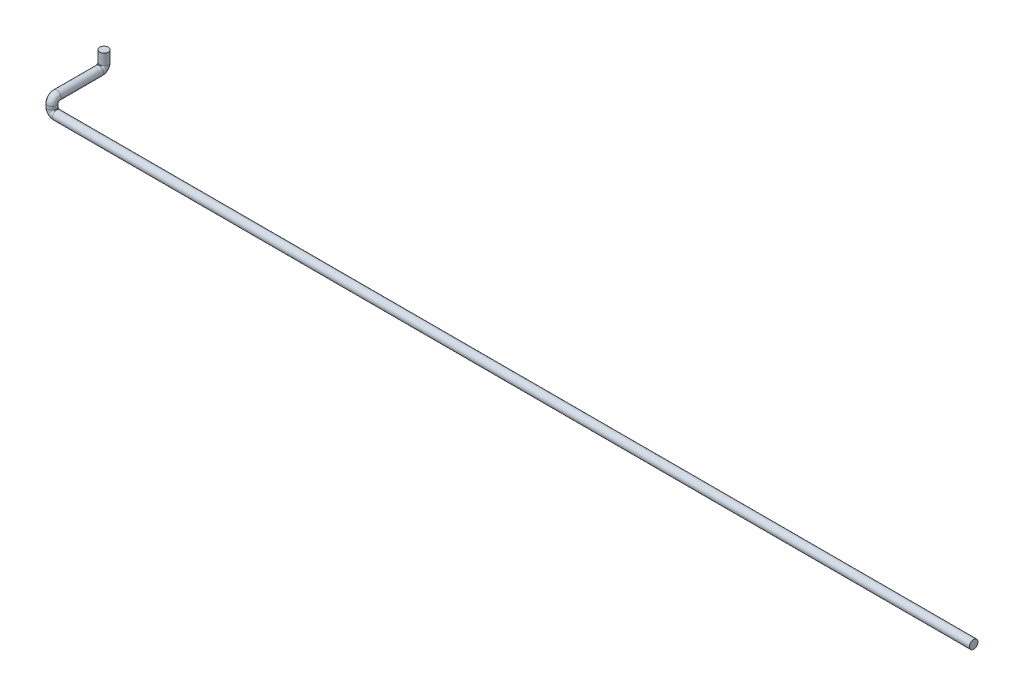
ISO-10303-21;
HEADER;
FILE_DESCRIPTION(('STEP AP214'),'2;1');
FILE_NAME('part.step','',(''),(''),'','','');
FILE_SCHEMA(('AUTOMOTIVE_DESIGN { 1 0 10303 214 1 1 1 1 }'));
ENDSEC;
DATA;
#1=APPLICATION_CONTEXT('core data for automotive mechanical design processes');
#2=APPLICATION_PROTOCOL_DEFINITION('international standard','automotive_design',2000,#1);
#3=PRODUCT_CONTEXT('',#1,'mechanical');
#4=PRODUCT('Part','Part','',(#3));
#5=PRODUCT_RELATED_PRODUCT_CATEGORY('part','',(#4));
#6=PRODUCT_DEFINITION_FORMATION('','',#4);
#7=PRODUCT_DEFINITION_CONTEXT('part definition',#1,'design');
#8=PRODUCT_DEFINITION('design','',#6,#7);
#9=PRODUCT_DEFINITION_SHAPE('','',#8);
#10=(LENGTH_UNIT() NAMED_UNIT(*) SI_UNIT(.MILLI.,.METRE.));
#11=(NAMED_UNIT(*) PLANE_ANGLE_UNIT() SI_UNIT($,.RADIAN.));
#12=(NAMED_UNIT(*) SI_UNIT($,.STERADIAN.) SOLID_ANGLE_UNIT());
#13=UNCERTAINTY_MEASURE_WITH_UNIT(LENGTH_MEASURE(1.E-05),#10,'distance_accuracy_value','');
#14=(GEOMETRIC_REPRESENTATION_CONTEXT(3) GLOBAL_UNCERTAINTY_ASSIGNED_CONTEXT((#13)) GLOBAL_UNIT_ASSIGNED_CONTEXT((#10,
#11,#12)) REPRESENTATION_CONTEXT('',''));
#15=CARTESIAN_POINT('',(0.,0.,0.));
#16=DIRECTION('',(0.,0.,1.));
#17=DIRECTION('',(1.,0.,0.));
#18=AXIS2_PLACEMENT_3D('',#15,#16,#17);
#19=CARTESIAN_POINT('',(0.,0.,0.));
#20=DIRECTION('',(1.,0.,0.));
#21=DIRECTION('',(0.,0.,-1.));
#22=AXIS2_PLACEMENT_3D('',#19,#20,#21);
#23=PLANE('',#22);
#24=CARTESIAN_POINT('',(0.,0.,0.));
#25=DIRECTION('',(1.,0.,0.));
#26=DIRECTION('',(0.,0.,-1.));
#27=AXIS2_PLACEMENT_3D('',#24,#25,#26);
#28=CIRCLE('',#27,13.7);
#29=CARTESIAN_POINT('',(0.,0.,-13.7));
#30=VERTEX_POINT('',#29);
#31=EDGE_CURVE('E49',#30,#30,#28,.T.);
#32=ORIENTED_EDGE('',*,*,#31,.T.);
#33=EDGE_LOOP('',(#32));
#34=FACE_BOUND('',#33,.T.);
#35=ADVANCED_FACE('F37',(#34),#23,.T.);
#36=CARTESIAN_POINT('',(-2945.,90.,-166.));
#37=DIRECTION('',(0.,-1.,0.));
#38=DIRECTION('',(0.,0.,-1.));
#39=AXIS2_PLACEMENT_3D('',#36,#37,#38);
#40=PLANE('',#39);
#41=CARTESIAN_POINT('',(-2945.,90.,-166.));
#42=DIRECTION('',(0.,-1.,0.));
#43=DIRECTION('',(0.,0.,-1.));
#44=AXIS2_PLACEMENT_3D('',#41,#42,#43);
#45=CIRCLE('',#44,13.7);
#46=CARTESIAN_POINT('',(-2945.,90.,-179.7));
#47=VERTEX_POINT('',#46);
#48=EDGE_CURVE('E11',#47,#47,#45,.T.);
#49=ORIENTED_EDGE('',*,*,#48,.F.);
#50=EDGE_LOOP('',(#49));
#51=FACE_BOUND('',#50,.T.);
#52=ADVANCED_FACE('F55',(#51),#40,.F.);
#53=CARTESIAN_POINT('',(0.,0.,0.));
#54=DIRECTION('',(-1.,0.,0.));
#55=DIRECTION('',(0.,0.,1.));
#56=AXIS2_PLACEMENT_3D('',#53,#54,#55);
#57=CYLINDRICAL_SURFACE('',#56,13.7);
#58=CARTESIAN_POINT('',(-2930.,0.,0.));
#59=DIRECTION('',(1.,0.,0.));
#60=DIRECTION('',(0.,0.,-1.));
#61=AXIS2_PLACEMENT_3D('',#58,#59,#60);
#62=CIRCLE('',#61,13.7);
#63=CARTESIAN_POINT('',(-2930.,-13.7000000000001,0.));
#64=VERTEX_POINT('',#63);
#65=EDGE_CURVE('E97',#64,#64,#62,.T.);
#66=ORIENTED_EDGE('',*,*,#65,.T.);
#67=EDGE_LOOP('',(#66));
#68=FACE_BOUND('',#67,.T.);
#69=ORIENTED_EDGE('',*,*,#31,.F.);
#70=EDGE_LOOP('',(#69));
#71=FACE_BOUND('',#70,.T.);
#72=ADVANCED_FACE('F57',(#68,#71),#57,.T.);
#73=CARTESIAN_POINT('',(-2930.,15.,0.));
#74=DIRECTION('',(0.,0.,-1.));
#75=DIRECTION('',(-1.,0.,0.));
#76=AXIS2_PLACEMENT_3D('',#73,#74,#75);
#77=TOROIDAL_SURFACE('',#76,15.0000000000001,13.7);
#78=CARTESIAN_POINT('',(-2945.,15.,0.));
#79=DIRECTION('',(0.,-1.,0.));
#80=DIRECTION('',(0.,0.,-1.));
#81=AXIS2_PLACEMENT_3D('',#78,#79,#80);
#82=CIRCLE('',#81,13.7);
#83=CARTESIAN_POINT('',(-2958.7,15.,0.));
#84=VERTEX_POINT('',#83);
#85=EDGE_CURVE('E94',#84,#84,#82,.T.);
#86=CARTESIAN_POINT('',(-2930.,15.,0.));
#87=DIRECTION('',(0.,0.,-1.));
#88=DIRECTION('',(-1.,0.,0.));
#89=AXIS2_PLACEMENT_3D('',#86,#87,#88);
#90=CIRCLE('',#89,28.7000000000001);
#91=EDGE_CURVE('',#64,#84,#90,.T.);
#92=ORIENTED_EDGE('',*,*,#65,.F.);
#93=ORIENTED_EDGE('',*,*,#85,.T.);
#94=ORIENTED_EDGE('',*,*,#91,.T.);
#95=ORIENTED_EDGE('',*,*,#91,.F.);
#96=EDGE_LOOP('',(#92,#94,#93,#95));
#97=FACE_BOUND('',#96,.T.);
#98=ADVANCED_FACE('F62',(#97),#77,.T.);
#99=CARTESIAN_POINT('',(-2945.,15.,0.));
#100=DIRECTION('',(0.,1.,0.));
#101=DIRECTION('',(0.,0.,1.));
#102=AXIS2_PLACEMENT_3D('',#99,#100,#101);
#103=CYLINDRICAL_SURFACE('',#102,13.7);
#104=CARTESIAN_POINT('',(-2945.,25.,0.));
#105=DIRECTION('',(0.,-1.,0.));
#106=DIRECTION('',(0.,0.,-1.));
#107=AXIS2_PLACEMENT_3D('',#104,#105,#106);
#108=CIRCLE('',#107,13.7);
#109=CARTESIAN_POINT('',(-2945.,25.,13.7));
#110=VERTEX_POINT('',#109);
#111=EDGE_CURVE('E99',#110,#110,#108,.T.);
#112=ORIENTED_EDGE('',*,*,#111,.T.);
#113=EDGE_LOOP('',(#112));
#114=FACE_BOUND('',#113,.T.);
#115=ORIENTED_EDGE('',*,*,#85,.F.);
#116=EDGE_LOOP('',(#115));
#117=FACE_BOUND('',#116,.T.);
#118=ADVANCED_FACE('F82',(#114,#117),#103,.T.);
#119=CARTESIAN_POINT('',(-2945.,25.,-15.));
#120=DIRECTION('',(-1.,0.,0.));
#121=DIRECTION('',(0.,0.,1.));
#122=AXIS2_PLACEMENT_3D('',#119,#120,#121);
#123=TOROIDAL_SURFACE('',#122,15.,13.7);
#124=CARTESIAN_POINT('',(-2945.,40.,-15.));
#125=DIRECTION('',(0.,0.,1.));
#126=DIRECTION('',(0.,-1.,0.));
#127=AXIS2_PLACEMENT_3D('',#124,#125,#126);
#128=CIRCLE('',#127,13.7);
#129=CARTESIAN_POINT('',(-2945.,53.7,-15.));
#130=VERTEX_POINT('',#129);
#131=EDGE_CURVE('E105',#130,#130,#128,.T.);
#132=CARTESIAN_POINT('',(-2945.,25.,-15.));
#133=DIRECTION('',(-1.,0.,0.));
#134=DIRECTION('',(0.,0.,1.));
#135=AXIS2_PLACEMENT_3D('',#132,#133,#134);
#136=CIRCLE('',#135,28.7);
#137=EDGE_CURVE('',#110,#130,#136,.T.);
#138=ORIENTED_EDGE('',*,*,#111,.F.);
#139=ORIENTED_EDGE('',*,*,#131,.T.);
#140=ORIENTED_EDGE('',*,*,#137,.T.);
#141=ORIENTED_EDGE('',*,*,#137,.F.);
#142=EDGE_LOOP('',(#138,#140,#139,#141));
#143=FACE_BOUND('',#142,.T.);
#144=ADVANCED_FACE('F78',(#143),#123,.T.);
#145=CARTESIAN_POINT('',(-2945.,40.,-15.));
#146=DIRECTION('',(0.,0.,-1.));
#147=DIRECTION('',(0.,1.,0.));
#148=AXIS2_PLACEMENT_3D('',#145,#146,#147);
#149=CYLINDRICAL_SURFACE('',#148,13.7);
#150=CARTESIAN_POINT('',(-2945.,40.,-151.));
#151=DIRECTION('',(0.,0.,1.));
#152=DIRECTION('',(0.,-1.,0.));
#153=AXIS2_PLACEMENT_3D('',#150,#151,#152);
#154=CIRCLE('',#153,13.7);
#155=CARTESIAN_POINT('',(-2945.,26.3,-151.));
#156=VERTEX_POINT('',#155);
#157=EDGE_CURVE('E108',#156,#156,#154,.T.);
#158=ORIENTED_EDGE('',*,*,#157,.T.);
#159=EDGE_LOOP('',(#158));
#160=FACE_BOUND('',#159,.T.);
#161=ORIENTED_EDGE('',*,*,#131,.F.);
#162=EDGE_LOOP('',(#161));
#163=FACE_BOUND('',#162,.T.);
#164=ADVANCED_FACE('F72',(#160,#163),#149,.T.);
#165=CARTESIAN_POINT('',(-2945.,55.,-151.));
#166=DIRECTION('',(1.,0.,0.));
#167=DIRECTION('',(0.,0.,-1.));
#168=AXIS2_PLACEMENT_3D('',#165,#166,#167);
#169=TOROIDAL_SURFACE('',#168,15.,13.7);
#170=CARTESIAN_POINT('',(-2945.,55.,-166.));
#171=DIRECTION('',(0.,-1.,0.));
#172=DIRECTION('',(0.,0.,-1.));
#173=AXIS2_PLACEMENT_3D('',#170,#171,#172);
#174=CIRCLE('',#173,13.7);
#175=CARTESIAN_POINT('',(-2945.,55.,-179.7));
#176=VERTEX_POINT('',#175);
#177=EDGE_CURVE('E44',#176,#176,#174,.T.);
#178=CARTESIAN_POINT('',(-2945.,55.,-151.));
#179=DIRECTION('',(1.,0.,0.));
#180=DIRECTION('',(0.,0.,-1.));
#181=AXIS2_PLACEMENT_3D('',#178,#179,#180);
#182=CIRCLE('',#181,28.7);
#183=EDGE_CURVE('',#156,#176,#182,.T.);
#184=ORIENTED_EDGE('',*,*,#157,.F.);
#185=ORIENTED_EDGE('',*,*,#177,.T.);
#186=ORIENTED_EDGE('',*,*,#183,.T.);
#187=ORIENTED_EDGE('',*,*,#183,.F.);
#188=EDGE_LOOP('',(#184,#186,#185,#187));
#189=FACE_BOUND('',#188,.T.);
#190=ADVANCED_FACE('F68',(#189),#169,.T.);
#191=CARTESIAN_POINT('',(-2945.,55.,-166.));
#192=DIRECTION('',(0.,1.,0.));
#193=DIRECTION('',(0.,0.,1.));
#194=AXIS2_PLACEMENT_3D('',#191,#192,#193);
#195=CYLINDRICAL_SURFACE('',#194,13.7);
#196=ORIENTED_EDGE('',*,*,#48,.T.);
#197=EDGE_LOOP('',(#196));
#198=FACE_BOUND('',#197,.T.);
#199=ORIENTED_EDGE('',*,*,#177,.F.);
#200=EDGE_LOOP('',(#199));
#201=FACE_BOUND('',#200,.T.);
#202=ADVANCED_FACE('F52',(#198,#201),#195,.T.);
#203=CLOSED_SHELL('',(#35,#52,#72,#98,#118,#144,#164,#190,#202));
#204=MANIFOLD_SOLID_BREP('B2',#203);
#205=ADVANCED_BREP_SHAPE_REPRESENTATION('',(#18,#204),#14);
#206=SHAPE_DEFINITION_REPRESENTATION(#9,#205);
ENDSEC;
END-ISO-10303-21;
